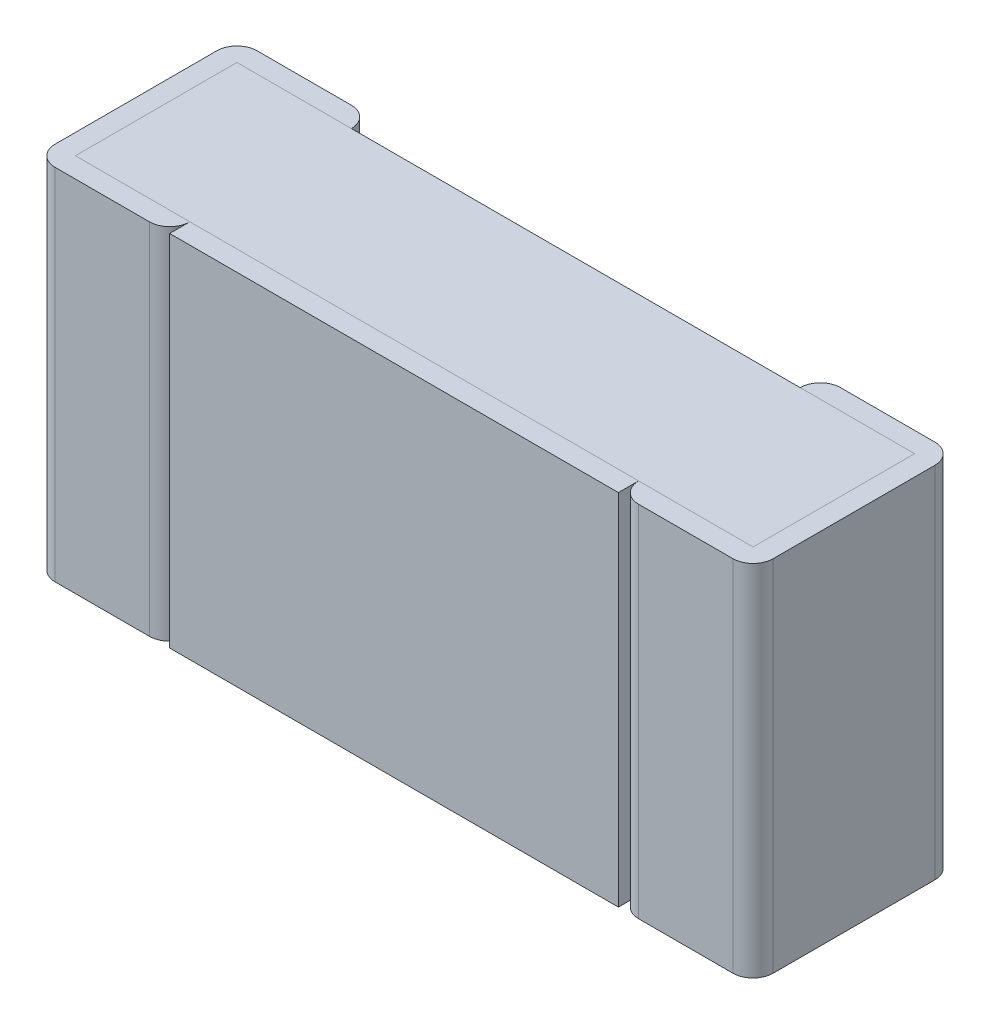
ISO-10303-21;
HEADER;
FILE_DESCRIPTION(('STEP AP214'),'2;1');
FILE_NAME('part.step','',(''),(''),'','','');
FILE_SCHEMA(('AUTOMOTIVE_DESIGN { 1 0 10303 214 1 1 1 1 }'));
ENDSEC;
DATA;
#1=APPLICATION_CONTEXT('core data for automotive mechanical design processes');
#2=APPLICATION_PROTOCOL_DEFINITION('international standard','automotive_design',2000,#1);
#3=PRODUCT_CONTEXT('',#1,'mechanical');
#4=PRODUCT('Part','Part','',(#3));
#5=PRODUCT_RELATED_PRODUCT_CATEGORY('part','',(#4));
#6=PRODUCT_DEFINITION_FORMATION('','',#4);
#7=PRODUCT_DEFINITION_CONTEXT('part definition',#1,'design');
#8=PRODUCT_DEFINITION('design','',#6,#7);
#9=PRODUCT_DEFINITION_SHAPE('','',#8);
#10=(LENGTH_UNIT() NAMED_UNIT(*) SI_UNIT(.MILLI.,.METRE.));
#11=(NAMED_UNIT(*) PLANE_ANGLE_UNIT() SI_UNIT($,.RADIAN.));
#12=(NAMED_UNIT(*) SI_UNIT($,.STERADIAN.) SOLID_ANGLE_UNIT());
#13=UNCERTAINTY_MEASURE_WITH_UNIT(LENGTH_MEASURE(1.E-05),#10,'distance_accuracy_value','');
#14=(GEOMETRIC_REPRESENTATION_CONTEXT(3) GLOBAL_UNCERTAINTY_ASSIGNED_CONTEXT((#13)) GLOBAL_UNIT_ASSIGNED_CONTEXT((#10,
#11,#12)) REPRESENTATION_CONTEXT('',''));
#15=CARTESIAN_POINT('',(0.,0.,0.));
#16=DIRECTION('',(0.,0.,1.));
#17=DIRECTION('',(1.,0.,0.));
#18=AXIS2_PLACEMENT_3D('',#15,#16,#17);
#19=CARTESIAN_POINT('',(-0.5,-0.4,0.45));
#20=DIRECTION('',(0.,0.,1.));
#21=DIRECTION('',(1.,0.,0.));
#22=AXIS2_PLACEMENT_3D('',#19,#20,#21);
#23=PLANE('',#22);
#24=DIRECTION('',(0.,1.,0.));
#25=VECTOR('',#24,1.);
#26=CARTESIAN_POINT('',(-0.5,-0.4,0.45));
#27=LINE('',#26,#25);
#28=CARTESIAN_POINT('',(-0.5,-0.4,0.45));
#29=VERTEX_POINT('',#28);
#30=CARTESIAN_POINT('',(-0.5,0.4,0.45));
#31=VERTEX_POINT('',#30);
#32=EDGE_CURVE('E268',#29,#31,#27,.T.);
#33=ORIENTED_EDGE('',*,*,#32,.F.);
#34=DIRECTION('',(1.,0.,0.));
#35=VECTOR('',#34,1.);
#36=CARTESIAN_POINT('',(-0.5,-0.4,0.45));
#37=LINE('',#36,#35);
#38=CARTESIAN_POINT('',(0.5,-0.4,0.45));
#39=VERTEX_POINT('',#38);
#40=EDGE_CURVE('E223',#29,#39,#37,.T.);
#41=ORIENTED_EDGE('',*,*,#40,.T.);
#42=DIRECTION('',(0.,1.,0.));
#43=VECTOR('',#42,1.);
#44=CARTESIAN_POINT('',(0.5,-0.4,0.45));
#45=LINE('',#44,#43);
#46=CARTESIAN_POINT('',(0.5,0.4,0.45));
#47=VERTEX_POINT('',#46);
#48=EDGE_CURVE('E11',#39,#47,#45,.T.);
#49=ORIENTED_EDGE('',*,*,#48,.T.);
#50=DIRECTION('',(1.,0.,0.));
#51=VECTOR('',#50,1.);
#52=CARTESIAN_POINT('',(-0.5,0.4,0.45));
#53=LINE('',#52,#51);
#54=EDGE_CURVE('E290',#31,#47,#53,.T.);
#55=ORIENTED_EDGE('',*,*,#54,.F.);
#56=EDGE_LOOP('',(#33,#41,#49,#55));
#57=FACE_BOUND('',#56,.T.);
#58=ADVANCED_FACE('F19',(#57),#23,.T.);
#59=CARTESIAN_POINT('',(0.5,-0.4,0.405));
#60=DIRECTION('',(1.,0.,0.));
#61=DIRECTION('',(0.,1.,0.));
#62=AXIS2_PLACEMENT_3D('',#59,#60,#61);
#63=PLANE('',#62);
#64=DIRECTION('',(0.,0.,1.));
#65=VECTOR('',#64,1.);
#66=CARTESIAN_POINT('',(0.5,-0.4,0.405));
#67=LINE('',#66,#65);
#68=CARTESIAN_POINT('',(0.5,-0.4,0.405));
#69=VERTEX_POINT('',#68);
#70=EDGE_CURVE('E219',#69,#39,#67,.T.);
#71=ORIENTED_EDGE('',*,*,#70,.F.);
#72=DIRECTION('',(0.,1.,0.));
#73=VECTOR('',#72,1.);
#74=CARTESIAN_POINT('',(0.5,-0.4,0.405));
#75=LINE('',#74,#73);
#76=CARTESIAN_POINT('',(0.5,0.4,0.405));
#77=VERTEX_POINT('',#76);
#78=EDGE_CURVE('E30',#69,#77,#75,.T.);
#79=ORIENTED_EDGE('',*,*,#78,.T.);
#80=DIRECTION('',(0.,0.,1.));
#81=VECTOR('',#80,1.);
#82=CARTESIAN_POINT('',(0.5,0.4,0.405));
#83=LINE('',#82,#81);
#84=EDGE_CURVE('E287',#77,#47,#83,.T.);
#85=ORIENTED_EDGE('',*,*,#84,.T.);
#86=ORIENTED_EDGE('',*,*,#48,.F.);
#87=EDGE_LOOP('',(#71,#79,#85,#86));
#88=FACE_BOUND('',#87,.T.);
#89=ADVANCED_FACE('F437',(#88),#63,.T.);
#90=CARTESIAN_POINT('',(0.545,-0.4,0.405));
#91=DIRECTION('',(0.,1.,0.));
#92=DIRECTION('',(-1.,0.,0.));
#93=AXIS2_PLACEMENT_3D('',#90,#91,#92);
#94=CYLINDRICAL_SURFACE('',#93,0.045);
#95=CARTESIAN_POINT('',(0.545,-0.4,0.405));
#96=DIRECTION('',(0.,1.,0.));
#97=DIRECTION('',(0.,0.,1.));
#98=AXIS2_PLACEMENT_3D('',#95,#96,#97);
#99=CIRCLE('',#98,0.045);
#100=CARTESIAN_POINT('',(0.545,-0.4,0.45));
#101=VERTEX_POINT('',#100);
#102=EDGE_CURVE('E349',#69,#101,#99,.T.);
#103=ORIENTED_EDGE('',*,*,#102,.T.);
#104=DIRECTION('',(0.,1.,0.));
#105=VECTOR('',#104,1.);
#106=CARTESIAN_POINT('',(0.545,-0.4,0.45));
#107=LINE('',#106,#105);
#108=CARTESIAN_POINT('',(0.545,0.4,0.45));
#109=VERTEX_POINT('',#108);
#110=EDGE_CURVE('E245',#101,#109,#107,.T.);
#111=ORIENTED_EDGE('',*,*,#110,.T.);
#112=CARTESIAN_POINT('',(0.545,0.4,0.405));
#113=DIRECTION('',(0.,1.,0.));
#114=DIRECTION('',(0.,0.,1.));
#115=AXIS2_PLACEMENT_3D('',#112,#113,#114);
#116=CIRCLE('',#115,0.045);
#117=EDGE_CURVE('E300',#77,#109,#116,.T.);
#118=ORIENTED_EDGE('',*,*,#117,.F.);
#119=ORIENTED_EDGE('',*,*,#78,.F.);
#120=EDGE_LOOP('',(#103,#111,#118,#119));
#121=FACE_BOUND('',#120,.T.);
#122=ADVANCED_FACE('F446',(#121),#94,.T.);
#123=CARTESIAN_POINT('',(0.5,-0.4,0.45));
#124=DIRECTION('',(0.,0.,1.));
#125=DIRECTION('',(1.,0.,0.));
#126=AXIS2_PLACEMENT_3D('',#123,#124,#125);
#127=PLANE('',#126);
#128=DIRECTION('',(1.,0.,0.));
#129=VECTOR('',#128,1.);
#130=CARTESIAN_POINT('',(0.5,0.4,0.45));
#131=LINE('',#130,#129);
#132=CARTESIAN_POINT('',(0.755,0.4,0.45));
#133=VERTEX_POINT('',#132);
#134=EDGE_CURVE('E259',#109,#133,#131,.T.);
#135=ORIENTED_EDGE('',*,*,#134,.F.);
#136=ORIENTED_EDGE('',*,*,#110,.F.);
#137=DIRECTION('',(1.,0.,0.));
#138=VECTOR('',#137,1.);
#139=CARTESIAN_POINT('',(0.5,-0.4,0.45));
#140=LINE('',#139,#138);
#141=CARTESIAN_POINT('',(0.755,-0.4,0.45));
#142=VERTEX_POINT('',#141);
#143=EDGE_CURVE('E345',#101,#142,#140,.T.);
#144=ORIENTED_EDGE('',*,*,#143,.T.);
#145=DIRECTION('',(0.,1.,0.));
#146=VECTOR('',#145,1.);
#147=CARTESIAN_POINT('',(0.755,-0.4,0.45));
#148=LINE('',#147,#146);
#149=EDGE_CURVE('E249',#142,#133,#148,.T.);
#150=ORIENTED_EDGE('',*,*,#149,.T.);
#151=EDGE_LOOP('',(#135,#136,#144,#150));
#152=FACE_BOUND('',#151,.T.);
#153=ADVANCED_FACE('F562',(#152),#127,.T.);
#154=CARTESIAN_POINT('',(0.755,-0.4,0.405));
#155=DIRECTION('',(0.,1.,0.));
#156=DIRECTION('',(1.,0.,0.));
#157=AXIS2_PLACEMENT_3D('',#154,#155,#156);
#158=CYLINDRICAL_SURFACE('',#157,0.045);
#159=DIRECTION('',(0.,1.,0.));
#160=VECTOR('',#159,1.);
#161=CARTESIAN_POINT('',(0.8,-0.4,0.405));
#162=LINE('',#161,#160);
#163=CARTESIAN_POINT('',(0.8,-0.4,0.405));
#164=VERTEX_POINT('',#163);
#165=CARTESIAN_POINT('',(0.8,0.4,0.405));
#166=VERTEX_POINT('',#165);
#167=EDGE_CURVE('E253',#164,#166,#162,.T.);
#168=ORIENTED_EDGE('',*,*,#167,.T.);
#169=CARTESIAN_POINT('',(0.755,0.4,0.405));
#170=DIRECTION('',(0.,-1.,0.));
#171=DIRECTION('',(0.,0.,1.));
#172=AXIS2_PLACEMENT_3D('',#169,#170,#171);
#173=CIRCLE('',#172,0.045);
#174=EDGE_CURVE('E254',#166,#133,#173,.T.);
#175=ORIENTED_EDGE('',*,*,#174,.T.);
#176=ORIENTED_EDGE('',*,*,#149,.F.);
#177=CARTESIAN_POINT('',(0.755,-0.4,0.405));
#178=DIRECTION('',(0.,-1.,0.));
#179=DIRECTION('',(0.,0.,1.));
#180=AXIS2_PLACEMENT_3D('',#177,#178,#179);
#181=CIRCLE('',#180,0.045);
#182=EDGE_CURVE('E324',#164,#142,#181,.T.);
#183=ORIENTED_EDGE('',*,*,#182,.F.);
#184=EDGE_LOOP('',(#168,#175,#176,#183));
#185=FACE_BOUND('',#184,.T.);
#186=ADVANCED_FACE('F553',(#185),#158,.T.);
#187=CARTESIAN_POINT('',(0.8,-0.4,0.));
#188=DIRECTION('',(1.,0.,0.));
#189=DIRECTION('',(0.,1.,0.));
#190=AXIS2_PLACEMENT_3D('',#187,#188,#189);
#191=PLANE('',#190);
#192=DIRECTION('',(0.,0.,1.));
#193=VECTOR('',#192,1.);
#194=CARTESIAN_POINT('',(0.8,-0.4,0.));
#195=LINE('',#194,#193);
#196=CARTESIAN_POINT('',(0.8,-0.4,0.045));
#197=VERTEX_POINT('',#196);
#198=EDGE_CURVE('E315',#197,#164,#195,.T.);
#199=ORIENTED_EDGE('',*,*,#198,.F.);
#200=DIRECTION('',(0.,1.,0.));
#201=VECTOR('',#200,1.);
#202=CARTESIAN_POINT('',(0.8,-0.4,0.045));
#203=LINE('',#202,#201);
#204=CARTESIAN_POINT('',(0.8,0.4,0.045));
#205=VERTEX_POINT('',#204);
#206=EDGE_CURVE('E243',#197,#205,#203,.T.);
#207=ORIENTED_EDGE('',*,*,#206,.T.);
#208=DIRECTION('',(0.,0.,1.));
#209=VECTOR('',#208,1.);
#210=CARTESIAN_POINT('',(0.8,0.4,0.));
#211=LINE('',#210,#209);
#212=EDGE_CURVE('E258',#205,#166,#211,.T.);
#213=ORIENTED_EDGE('',*,*,#212,.T.);
#214=ORIENTED_EDGE('',*,*,#167,.F.);
#215=EDGE_LOOP('',(#199,#207,#213,#214));
#216=FACE_BOUND('',#215,.T.);
#217=ADVANCED_FACE('F549',(#216),#191,.T.);
#218=CARTESIAN_POINT('',(0.755,-0.4,0.045));
#219=DIRECTION('',(0.,1.,0.));
#220=DIRECTION('',(1.,0.,0.));
#221=AXIS2_PLACEMENT_3D('',#218,#219,#220);
#222=CYLINDRICAL_SURFACE('',#221,0.045);
#223=CARTESIAN_POINT('',(0.755,-0.4,0.045));
#224=DIRECTION('',(0.,1.,0.));
#225=DIRECTION('',(0.,0.,1.));
#226=AXIS2_PLACEMENT_3D('',#223,#224,#225);
#227=CIRCLE('',#226,0.045);
#228=CARTESIAN_POINT('',(0.755,-0.4,0.));
#229=VERTEX_POINT('',#228);
#230=EDGE_CURVE('E311',#197,#229,#227,.T.);
#231=ORIENTED_EDGE('',*,*,#230,.T.);
#232=DIRECTION('',(0.,1.,0.));
#233=VECTOR('',#232,1.);
#234=CARTESIAN_POINT('',(0.755,-0.4,0.));
#235=LINE('',#234,#233);
#236=CARTESIAN_POINT('',(0.755,0.4,0.));
#237=VERTEX_POINT('',#236);
#238=EDGE_CURVE('E240',#229,#237,#235,.T.);
#239=ORIENTED_EDGE('',*,*,#238,.T.);
#240=CARTESIAN_POINT('',(0.755,0.4,0.045));
#241=DIRECTION('',(0.,1.,0.));
#242=DIRECTION('',(0.,0.,1.));
#243=AXIS2_PLACEMENT_3D('',#240,#241,#242);
#244=CIRCLE('',#243,0.045);
#245=EDGE_CURVE('E386',#205,#237,#244,.T.);
#246=ORIENTED_EDGE('',*,*,#245,.F.);
#247=ORIENTED_EDGE('',*,*,#206,.F.);
#248=EDGE_LOOP('',(#231,#239,#246,#247));
#249=FACE_BOUND('',#248,.T.);
#250=ADVANCED_FACE('F555',(#249),#222,.T.);
#251=CARTESIAN_POINT('',(0.5,-0.4,0.));
#252=DIRECTION('',(0.,0.,1.));
#253=DIRECTION('',(1.,0.,0.));
#254=AXIS2_PLACEMENT_3D('',#251,#252,#253);
#255=PLANE('',#254);
#256=ORIENTED_EDGE('',*,*,#238,.F.);
#257=DIRECTION('',(1.,0.,0.));
#258=VECTOR('',#257,1.);
#259=CARTESIAN_POINT('',(0.5,-0.4,0.));
#260=LINE('',#259,#258);
#261=CARTESIAN_POINT('',(0.545,-0.4,0.));
#262=VERTEX_POINT('',#261);
#263=EDGE_CURVE('E224',#262,#229,#260,.T.);
#264=ORIENTED_EDGE('',*,*,#263,.F.);
#265=DIRECTION('',(0.,1.,0.));
#266=VECTOR('',#265,1.);
#267=CARTESIAN_POINT('',(0.545,-0.4,0.));
#268=LINE('',#267,#266);
#269=CARTESIAN_POINT('',(0.545,0.4,0.));
#270=VERTEX_POINT('',#269);
#271=EDGE_CURVE('E244',#262,#270,#268,.T.);
#272=ORIENTED_EDGE('',*,*,#271,.T.);
#273=DIRECTION('',(1.,0.,0.));
#274=VECTOR('',#273,1.);
#275=CARTESIAN_POINT('',(0.5,0.4,0.));
#276=LINE('',#275,#274);
#277=EDGE_CURVE('E267',#270,#237,#276,.T.);
#278=ORIENTED_EDGE('',*,*,#277,.T.);
#279=EDGE_LOOP('',(#256,#264,#272,#278));
#280=FACE_BOUND('',#279,.T.);
#281=ADVANCED_FACE('F582',(#280),#255,.F.);
#282=CARTESIAN_POINT('',(0.545,-0.4,0.045));
#283=DIRECTION('',(0.,1.,0.));
#284=DIRECTION('',(-1.,0.,0.));
#285=AXIS2_PLACEMENT_3D('',#282,#283,#284);
#286=CYLINDRICAL_SURFACE('',#285,0.045);
#287=DIRECTION('',(0.,1.,0.));
#288=VECTOR('',#287,1.);
#289=CARTESIAN_POINT('',(0.5,-0.4,0.045));
#290=LINE('',#289,#288);
#291=CARTESIAN_POINT('',(0.5,-0.4,0.045));
#292=VERTEX_POINT('',#291);
#293=CARTESIAN_POINT('',(0.5,0.4,0.045));
#294=VERTEX_POINT('',#293);
#295=EDGE_CURVE('E234',#292,#294,#290,.T.);
#296=ORIENTED_EDGE('',*,*,#295,.T.);
#297=CARTESIAN_POINT('',(0.545,0.4,0.045));
#298=DIRECTION('',(0.,-1.,0.));
#299=DIRECTION('',(0.,0.,1.));
#300=AXIS2_PLACEMENT_3D('',#297,#298,#299);
#301=CIRCLE('',#300,0.045);
#302=EDGE_CURVE('E23',#294,#270,#301,.T.);
#303=ORIENTED_EDGE('',*,*,#302,.T.);
#304=ORIENTED_EDGE('',*,*,#271,.F.);
#305=CARTESIAN_POINT('',(0.545,-0.4,0.045));
#306=DIRECTION('',(0.,-1.,0.));
#307=DIRECTION('',(0.,0.,1.));
#308=AXIS2_PLACEMENT_3D('',#305,#306,#307);
#309=CIRCLE('',#308,0.045);
#310=EDGE_CURVE('E377',#292,#262,#309,.T.);
#311=ORIENTED_EDGE('',*,*,#310,.F.);
#312=EDGE_LOOP('',(#296,#303,#304,#311));
#313=FACE_BOUND('',#312,.T.);
#314=ADVANCED_FACE('F524',(#313),#286,.T.);
#315=CARTESIAN_POINT('',(-0.5,0.4,0.405));
#316=DIRECTION('',(0.,1.,0.));
#317=DIRECTION('',(1.,0.,0.));
#318=AXIS2_PLACEMENT_3D('',#315,#316,#317);
#319=PLANE('',#318);
#320=DIRECTION('',(1.,0.,0.));
#321=VECTOR('',#320,1.);
#322=CARTESIAN_POINT('',(-0.5,0.4,0.405));
#323=LINE('',#322,#321);
#324=CARTESIAN_POINT('',(-0.5,0.4,0.405));
#325=VERTEX_POINT('',#324);
#326=EDGE_CURVE('E277',#325,#77,#323,.T.);
#327=ORIENTED_EDGE('',*,*,#326,.F.);
#328=DIRECTION('',(0.,0.,1.));
#329=VECTOR('',#328,1.);
#330=CARTESIAN_POINT('',(-0.5,0.4,0.405));
#331=LINE('',#330,#329);
#332=EDGE_CURVE('E263',#325,#31,#331,.T.);
#333=ORIENTED_EDGE('',*,*,#332,.T.);
#334=ORIENTED_EDGE('',*,*,#54,.T.);
#335=ORIENTED_EDGE('',*,*,#84,.F.);
#336=EDGE_LOOP('',(#327,#333,#334,#335));
#337=FACE_BOUND('',#336,.T.);
#338=ADVANCED_FACE('F482',(#337),#319,.T.);
#339=CARTESIAN_POINT('',(0.5,0.4,0.));
#340=DIRECTION('',(0.,1.,0.));
#341=DIRECTION('',(1.,0.,0.));
#342=AXIS2_PLACEMENT_3D('',#339,#340,#341);
#343=PLANE('',#342);
#344=ORIENTED_EDGE('',*,*,#277,.F.);
#345=ORIENTED_EDGE('',*,*,#302,.F.);
#346=DIRECTION('',(1.,0.,0.));
#347=VECTOR('',#346,1.);
#348=CARTESIAN_POINT('',(-0.755,0.4,0.045));
#349=LINE('',#348,#347);
#350=CARTESIAN_POINT('',(0.755,0.4,0.045));
#351=VERTEX_POINT('',#350);
#352=EDGE_CURVE('E235',#294,#351,#349,.T.);
#353=ORIENTED_EDGE('',*,*,#352,.T.);
#354=DIRECTION('',(0.,0.,1.));
#355=VECTOR('',#354,1.);
#356=CARTESIAN_POINT('',(0.755,0.4,0.045));
#357=LINE('',#356,#355);
#358=CARTESIAN_POINT('',(0.755,0.4,0.405));
#359=VERTEX_POINT('',#358);
#360=EDGE_CURVE('E239',#351,#359,#357,.T.);
#361=ORIENTED_EDGE('',*,*,#360,.T.);
#362=DIRECTION('',(1.,0.,0.));
#363=VECTOR('',#362,1.);
#364=CARTESIAN_POINT('',(-0.755,0.4,0.405));
#365=LINE('',#364,#363);
#366=EDGE_CURVE('E293',#77,#359,#365,.T.);
#367=ORIENTED_EDGE('',*,*,#366,.F.);
#368=ORIENTED_EDGE('',*,*,#117,.T.);
#369=ORIENTED_EDGE('',*,*,#134,.T.);
#370=ORIENTED_EDGE('',*,*,#174,.F.);
#371=ORIENTED_EDGE('',*,*,#212,.F.);
#372=ORIENTED_EDGE('',*,*,#245,.T.);
#373=EDGE_LOOP('',(#344,#345,#353,#361,#367,#368,#369,#370,#371,#372));
#374=FACE_BOUND('',#373,.T.);
#375=ADVANCED_FACE('F559',(#374),#343,.T.);
#376=CARTESIAN_POINT('',(-0.5,-0.4,0.405));
#377=DIRECTION('',(1.,0.,0.));
#378=DIRECTION('',(0.,1.,0.));
#379=AXIS2_PLACEMENT_3D('',#376,#377,#378);
#380=PLANE('',#379);
#381=ORIENTED_EDGE('',*,*,#32,.T.);
#382=ORIENTED_EDGE('',*,*,#332,.F.);
#383=DIRECTION('',(0.,1.,0.));
#384=VECTOR('',#383,1.);
#385=CARTESIAN_POINT('',(-0.5,-0.4,0.405));
#386=LINE('',#385,#384);
#387=CARTESIAN_POINT('',(-0.5,-0.4,0.405));
#388=VERTEX_POINT('',#387);
#389=EDGE_CURVE('E273',#388,#325,#386,.T.);
#390=ORIENTED_EDGE('',*,*,#389,.F.);
#391=DIRECTION('',(0.,0.,1.));
#392=VECTOR('',#391,1.);
#393=CARTESIAN_POINT('',(-0.5,-0.4,0.405));
#394=LINE('',#393,#392);
#395=EDGE_CURVE('E98',#388,#29,#394,.T.);
#396=ORIENTED_EDGE('',*,*,#395,.T.);
#397=EDGE_LOOP('',(#381,#382,#390,#396));
#398=FACE_BOUND('',#397,.T.);
#399=ADVANCED_FACE('F427',(#398),#380,.F.);
#400=CARTESIAN_POINT('',(-0.5,-0.4,0.405));
#401=DIRECTION('',(0.,1.,0.));
#402=DIRECTION('',(1.,0.,0.));
#403=AXIS2_PLACEMENT_3D('',#400,#401,#402);
#404=PLANE('',#403);
#405=ORIENTED_EDGE('',*,*,#70,.T.);
#406=ORIENTED_EDGE('',*,*,#40,.F.);
#407=ORIENTED_EDGE('',*,*,#395,.F.);
#408=DIRECTION('',(1.,0.,0.));
#409=VECTOR('',#408,1.);
#410=CARTESIAN_POINT('',(-0.5,-0.4,0.405));
#411=LINE('',#410,#409);
#412=EDGE_CURVE('E228',#388,#69,#411,.T.);
#413=ORIENTED_EDGE('',*,*,#412,.T.);
#414=EDGE_LOOP('',(#405,#406,#407,#413));
#415=FACE_BOUND('',#414,.T.);
#416=ADVANCED_FACE('F431',(#415),#404,.F.);
#417=CARTESIAN_POINT('',(0.5,-0.4,0.));
#418=DIRECTION('',(0.,1.,0.));
#419=DIRECTION('',(1.,0.,0.));
#420=AXIS2_PLACEMENT_3D('',#417,#418,#419);
#421=PLANE('',#420);
#422=ORIENTED_EDGE('',*,*,#230,.F.);
#423=ORIENTED_EDGE('',*,*,#198,.T.);
#424=ORIENTED_EDGE('',*,*,#182,.T.);
#425=ORIENTED_EDGE('',*,*,#143,.F.);
#426=ORIENTED_EDGE('',*,*,#102,.F.);
#427=DIRECTION('',(1.,0.,0.));
#428=VECTOR('',#427,1.);
#429=CARTESIAN_POINT('',(-0.755,-0.4,0.405));
#430=LINE('',#429,#428);
#431=CARTESIAN_POINT('',(0.755,-0.4,0.405));
#432=VERTEX_POINT('',#431);
#433=EDGE_CURVE('E225',#69,#432,#430,.T.);
#434=ORIENTED_EDGE('',*,*,#433,.T.);
#435=DIRECTION('',(0.,0.,1.));
#436=VECTOR('',#435,1.);
#437=CARTESIAN_POINT('',(0.755,-0.4,0.045));
#438=LINE('',#437,#436);
#439=CARTESIAN_POINT('',(0.755,-0.4,0.045));
#440=VERTEX_POINT('',#439);
#441=EDGE_CURVE('E229',#440,#432,#438,.T.);
#442=ORIENTED_EDGE('',*,*,#441,.F.);
#443=DIRECTION('',(1.,0.,0.));
#444=VECTOR('',#443,1.);
#445=CARTESIAN_POINT('',(-0.755,-0.4,0.045));
#446=LINE('',#445,#444);
#447=EDGE_CURVE('E271',#292,#440,#446,.T.);
#448=ORIENTED_EDGE('',*,*,#447,.F.);
#449=ORIENTED_EDGE('',*,*,#310,.T.);
#450=ORIENTED_EDGE('',*,*,#263,.T.);
#451=EDGE_LOOP('',(#422,#423,#424,#425,#426,#434,#442,#448,#449,#450));
#452=FACE_BOUND('',#451,.T.);
#453=ADVANCED_FACE('F442',(#452),#421,.F.);
#454=CARTESIAN_POINT('',(-0.755,-0.4,0.045));
#455=DIRECTION('',(0.,0.,1.));
#456=DIRECTION('',(1.,0.,0.));
#457=AXIS2_PLACEMENT_3D('',#454,#455,#456);
#458=PLANE('',#457);
#459=DIRECTION('',(1.,0.,0.));
#460=VECTOR('',#459,1.);
#461=CARTESIAN_POINT('',(-0.755,0.4,0.045));
#462=LINE('',#461,#460);
#463=CARTESIAN_POINT('',(-0.5,0.4,0.045));
#464=VERTEX_POINT('',#463);
#465=EDGE_CURVE('E230',#464,#294,#462,.T.);
#466=ORIENTED_EDGE('',*,*,#465,.T.);
#467=ORIENTED_EDGE('',*,*,#295,.F.);
#468=DIRECTION('',(1.,0.,0.));
#469=VECTOR('',#468,1.);
#470=CARTESIAN_POINT('',(-0.755,-0.4,0.045));
#471=LINE('',#470,#469);
#472=CARTESIAN_POINT('',(-0.5,-0.4,0.045));
#473=VERTEX_POINT('',#472);
#474=EDGE_CURVE('E308',#473,#292,#471,.T.);
#475=ORIENTED_EDGE('',*,*,#474,.F.);
#476=DIRECTION('',(0.,1.,0.));
#477=VECTOR('',#476,1.);
#478=CARTESIAN_POINT('',(-0.5,-0.4,0.045));
#479=LINE('',#478,#477);
#480=EDGE_CURVE('E181',#473,#464,#479,.T.);
#481=ORIENTED_EDGE('',*,*,#480,.T.);
#482=EDGE_LOOP('',(#466,#467,#475,#481));
#483=FACE_BOUND('',#482,.T.);
#484=ADVANCED_FACE('F528',(#483),#458,.F.);
#485=CARTESIAN_POINT('',(-0.755,0.4,0.045));
#486=DIRECTION('',(0.,1.,0.));
#487=DIRECTION('',(1.,0.,0.));
#488=AXIS2_PLACEMENT_3D('',#485,#486,#487);
#489=PLANE('',#488);
#490=DIRECTION('',(1.,0.,0.));
#491=VECTOR('',#490,1.);
#492=CARTESIAN_POINT('',(-0.755,0.4,0.045));
#493=LINE('',#492,#491);
#494=CARTESIAN_POINT('',(-0.755,0.4,0.045));
#495=VERTEX_POINT('',#494);
#496=EDGE_CURVE('E189',#495,#464,#493,.T.);
#497=ORIENTED_EDGE('',*,*,#496,.F.);
#498=DIRECTION('',(0.,0.,1.));
#499=VECTOR('',#498,1.);
#500=CARTESIAN_POINT('',(-0.755,0.4,0.045));
#501=LINE('',#500,#499);
#502=CARTESIAN_POINT('',(-0.755,0.4,0.405));
#503=VERTEX_POINT('',#502);
#504=EDGE_CURVE('E262',#495,#503,#501,.T.);
#505=ORIENTED_EDGE('',*,*,#504,.T.);
#506=DIRECTION('',(1.,0.,0.));
#507=VECTOR('',#506,1.);
#508=CARTESIAN_POINT('',(-0.755,0.4,0.405));
#509=LINE('',#508,#507);
#510=EDGE_CURVE('E392',#503,#325,#509,.T.);
#511=ORIENTED_EDGE('',*,*,#510,.T.);
#512=ORIENTED_EDGE('',*,*,#326,.T.);
#513=ORIENTED_EDGE('',*,*,#366,.T.);
#514=ORIENTED_EDGE('',*,*,#360,.F.);
#515=ORIENTED_EDGE('',*,*,#352,.F.);
#516=ORIENTED_EDGE('',*,*,#465,.F.);
#517=EDGE_LOOP('',(#497,#505,#511,#512,#513,#514,#515,#516));
#518=FACE_BOUND('',#517,.T.);
#519=ADVANCED_FACE('F415',(#518),#489,.T.);
#520=CARTESIAN_POINT('',(-0.545,-0.4,0.405));
#521=DIRECTION('',(0.,1.,0.));
#522=DIRECTION('',(1.,0.,0.));
#523=AXIS2_PLACEMENT_3D('',#520,#521,#522);
#524=CYLINDRICAL_SURFACE('',#523,0.045);
#525=ORIENTED_EDGE('',*,*,#389,.T.);
#526=CARTESIAN_POINT('',(-0.545,0.4,0.405));
#527=DIRECTION('',(0.,-1.,0.));
#528=DIRECTION('',(0.,0.,1.));
#529=AXIS2_PLACEMENT_3D('',#526,#527,#528);
#530=CIRCLE('',#529,0.045);
#531=CARTESIAN_POINT('',(-0.545,0.4,0.45));
#532=VERTEX_POINT('',#531);
#533=EDGE_CURVE('E205',#325,#532,#530,.T.);
#534=ORIENTED_EDGE('',*,*,#533,.T.);
#535=DIRECTION('',(0.,1.,0.));
#536=VECTOR('',#535,1.);
#537=CARTESIAN_POINT('',(-0.545,-0.4,0.45));
#538=LINE('',#537,#536);
#539=CARTESIAN_POINT('',(-0.545,-0.4,0.45));
#540=VERTEX_POINT('',#539);
#541=EDGE_CURVE('E83',#540,#532,#538,.T.);
#542=ORIENTED_EDGE('',*,*,#541,.F.);
#543=CARTESIAN_POINT('',(-0.545,-0.4,0.405));
#544=DIRECTION('',(0.,-1.,0.));
#545=DIRECTION('',(0.,0.,1.));
#546=AXIS2_PLACEMENT_3D('',#543,#544,#545);
#547=CIRCLE('',#546,0.045);
#548=EDGE_CURVE('E281',#388,#540,#547,.T.);
#549=ORIENTED_EDGE('',*,*,#548,.F.);
#550=EDGE_LOOP('',(#525,#534,#542,#549));
#551=FACE_BOUND('',#550,.T.);
#552=ADVANCED_FACE('F423',(#551),#524,.T.);
#553=CARTESIAN_POINT('',(-0.8,-0.4,0.45));
#554=DIRECTION('',(0.,0.,1.));
#555=DIRECTION('',(1.,0.,0.));
#556=AXIS2_PLACEMENT_3D('',#553,#554,#555);
#557=PLANE('',#556);
#558=DIRECTION('',(1.,0.,0.));
#559=VECTOR('',#558,1.);
#560=CARTESIAN_POINT('',(-0.8,0.4,0.45));
#561=LINE('',#560,#559);
#562=CARTESIAN_POINT('',(-0.755,0.4,0.45));
#563=VERTEX_POINT('',#562);
#564=EDGE_CURVE('E197',#563,#532,#561,.T.);
#565=ORIENTED_EDGE('',*,*,#564,.F.);
#566=DIRECTION('',(0.,1.,0.));
#567=VECTOR('',#566,1.);
#568=CARTESIAN_POINT('',(-0.755,-0.4,0.45));
#569=LINE('',#568,#567);
#570=CARTESIAN_POINT('',(-0.755,-0.4,0.45));
#571=VERTEX_POINT('',#570);
#572=EDGE_CURVE('E209',#571,#563,#569,.T.);
#573=ORIENTED_EDGE('',*,*,#572,.F.);
#574=DIRECTION('',(1.,0.,0.));
#575=VECTOR('',#574,1.);
#576=CARTESIAN_POINT('',(-0.8,-0.4,0.45));
#577=LINE('',#576,#575);
#578=EDGE_CURVE('E285',#571,#540,#577,.T.);
#579=ORIENTED_EDGE('',*,*,#578,.T.);
#580=ORIENTED_EDGE('',*,*,#541,.T.);
#581=EDGE_LOOP('',(#565,#573,#579,#580));
#582=FACE_BOUND('',#581,.T.);
#583=ADVANCED_FACE('F642',(#582),#557,.T.);
#584=CARTESIAN_POINT('',(-0.755,-0.4,0.045));
#585=DIRECTION('',(0.,1.,0.));
#586=DIRECTION('',(1.,0.,0.));
#587=AXIS2_PLACEMENT_3D('',#584,#585,#586);
#588=PLANE('',#587);
#589=ORIENTED_EDGE('',*,*,#474,.T.);
#590=ORIENTED_EDGE('',*,*,#447,.T.);
#591=ORIENTED_EDGE('',*,*,#441,.T.);
#592=ORIENTED_EDGE('',*,*,#433,.F.);
#593=ORIENTED_EDGE('',*,*,#412,.F.);
#594=DIRECTION('',(1.,0.,0.));
#595=VECTOR('',#594,1.);
#596=CARTESIAN_POINT('',(-0.755,-0.4,0.405));
#597=LINE('',#596,#595);
#598=CARTESIAN_POINT('',(-0.755,-0.4,0.405));
#599=VERTEX_POINT('',#598);
#600=EDGE_CURVE('E286',#599,#388,#597,.T.);
#601=ORIENTED_EDGE('',*,*,#600,.F.);
#602=DIRECTION('',(0.,0.,1.));
#603=VECTOR('',#602,1.);
#604=CARTESIAN_POINT('',(-0.755,-0.4,0.045));
#605=LINE('',#604,#603);
#606=CARTESIAN_POINT('',(-0.755,-0.4,0.045));
#607=VERTEX_POINT('',#606);
#608=EDGE_CURVE('E304',#607,#599,#605,.T.);
#609=ORIENTED_EDGE('',*,*,#608,.F.);
#610=DIRECTION('',(1.,0.,0.));
#611=VECTOR('',#610,1.);
#612=CARTESIAN_POINT('',(-0.755,-0.4,0.045));
#613=LINE('',#612,#611);
#614=EDGE_CURVE('E213',#607,#473,#613,.T.);
#615=ORIENTED_EDGE('',*,*,#614,.T.);
#616=EDGE_LOOP('',(#589,#590,#591,#592,#593,#601,#609,#615));
#617=FACE_BOUND('',#616,.T.);
#618=ADVANCED_FACE('F21',(#617),#588,.F.);
#619=CARTESIAN_POINT('',(-0.545,-0.4,0.045));
#620=DIRECTION('',(0.,1.,0.));
#621=DIRECTION('',(1.,0.,0.));
#622=AXIS2_PLACEMENT_3D('',#619,#620,#621);
#623=CYLINDRICAL_SURFACE('',#622,0.045);
#624=CARTESIAN_POINT('',(-0.545,-0.4,0.045));
#625=DIRECTION('',(0.,1.,0.));
#626=DIRECTION('',(0.,0.,1.));
#627=AXIS2_PLACEMENT_3D('',#624,#625,#626);
#628=CIRCLE('',#627,0.045);
#629=CARTESIAN_POINT('',(-0.545,-0.4,0.));
#630=VERTEX_POINT('',#629);
#631=EDGE_CURVE('E175',#473,#630,#628,.T.);
#632=ORIENTED_EDGE('',*,*,#631,.T.);
#633=DIRECTION('',(0.,1.,0.));
#634=VECTOR('',#633,1.);
#635=CARTESIAN_POINT('',(-0.545,-0.4,0.));
#636=LINE('',#635,#634);
#637=CARTESIAN_POINT('',(-0.545,0.4,0.));
#638=VERTEX_POINT('',#637);
#639=EDGE_CURVE('E168',#630,#638,#636,.T.);
#640=ORIENTED_EDGE('',*,*,#639,.T.);
#641=CARTESIAN_POINT('',(-0.545,0.4,0.045));
#642=DIRECTION('',(0.,1.,0.));
#643=DIRECTION('',(0.,0.,1.));
#644=AXIS2_PLACEMENT_3D('',#641,#642,#643);
#645=CIRCLE('',#644,0.045);
#646=EDGE_CURVE('E172',#464,#638,#645,.T.);
#647=ORIENTED_EDGE('',*,*,#646,.F.);
#648=ORIENTED_EDGE('',*,*,#480,.F.);
#649=EDGE_LOOP('',(#632,#640,#647,#648));
#650=FACE_BOUND('',#649,.T.);
#651=ADVANCED_FACE('F170',(#650),#623,.T.);
#652=CARTESIAN_POINT('',(-0.8,-0.4,0.));
#653=DIRECTION('',(0.,0.,1.));
#654=DIRECTION('',(1.,0.,0.));
#655=AXIS2_PLACEMENT_3D('',#652,#653,#654);
#656=PLANE('',#655);
#657=ORIENTED_EDGE('',*,*,#639,.F.);
#658=DIRECTION('',(1.,0.,0.));
#659=VECTOR('',#658,1.);
#660=CARTESIAN_POINT('',(-0.8,-0.4,0.));
#661=LINE('',#660,#659);
#662=CARTESIAN_POINT('',(-0.755,-0.4,0.));
#663=VERTEX_POINT('',#662);
#664=EDGE_CURVE('E331',#663,#630,#661,.T.);
#665=ORIENTED_EDGE('',*,*,#664,.F.);
#666=DIRECTION('',(0.,1.,0.));
#667=VECTOR('',#666,1.);
#668=CARTESIAN_POINT('',(-0.755,-0.4,0.));
#669=LINE('',#668,#667);
#670=CARTESIAN_POINT('',(-0.755,0.4,0.));
#671=VERTEX_POINT('',#670);
#672=EDGE_CURVE('E194',#663,#671,#669,.T.);
#673=ORIENTED_EDGE('',*,*,#672,.T.);
#674=DIRECTION('',(1.,0.,0.));
#675=VECTOR('',#674,1.);
#676=CARTESIAN_POINT('',(-0.8,0.4,0.));
#677=LINE('',#676,#675);
#678=EDGE_CURVE('E186',#671,#638,#677,.T.);
#679=ORIENTED_EDGE('',*,*,#678,.T.);
#680=EDGE_LOOP('',(#657,#665,#673,#679));
#681=FACE_BOUND('',#680,.T.);
#682=ADVANCED_FACE('F192',(#681),#656,.F.);
#683=CARTESIAN_POINT('',(-0.8,0.4,0.));
#684=DIRECTION('',(0.,1.,0.));
#685=DIRECTION('',(1.,0.,0.));
#686=AXIS2_PLACEMENT_3D('',#683,#684,#685);
#687=PLANE('',#686);
#688=ORIENTED_EDGE('',*,*,#678,.F.);
#689=CARTESIAN_POINT('',(-0.755,0.4,0.045));
#690=DIRECTION('',(0.,-1.,0.));
#691=DIRECTION('',(0.,0.,1.));
#692=AXIS2_PLACEMENT_3D('',#689,#690,#691);
#693=CIRCLE('',#692,0.045);
#694=CARTESIAN_POINT('',(-0.8,0.4,0.045));
#695=VERTEX_POINT('',#694);
#696=EDGE_CURVE('E334',#695,#671,#693,.T.);
#697=ORIENTED_EDGE('',*,*,#696,.F.);
#698=DIRECTION('',(0.,0.,1.));
#699=VECTOR('',#698,1.);
#700=CARTESIAN_POINT('',(-0.8,0.4,0.));
#701=LINE('',#700,#699);
#702=CARTESIAN_POINT('',(-0.8,0.4,0.405));
#703=VERTEX_POINT('',#702);
#704=EDGE_CURVE('E218',#695,#703,#701,.T.);
#705=ORIENTED_EDGE('',*,*,#704,.T.);
#706=CARTESIAN_POINT('',(-0.755,0.4,0.405));
#707=DIRECTION('',(0.,1.,0.));
#708=DIRECTION('',(0.,0.,1.));
#709=AXIS2_PLACEMENT_3D('',#706,#707,#708);
#710=CIRCLE('',#709,0.045);
#711=EDGE_CURVE('E198',#703,#563,#710,.T.);
#712=ORIENTED_EDGE('',*,*,#711,.T.);
#713=ORIENTED_EDGE('',*,*,#564,.T.);
#714=ORIENTED_EDGE('',*,*,#533,.F.);
#715=ORIENTED_EDGE('',*,*,#510,.F.);
#716=ORIENTED_EDGE('',*,*,#504,.F.);
#717=ORIENTED_EDGE('',*,*,#496,.T.);
#718=ORIENTED_EDGE('',*,*,#646,.T.);
#719=EDGE_LOOP('',(#688,#697,#705,#712,#713,#714,#715,#716,#717,#718));
#720=FACE_BOUND('',#719,.T.);
#721=ADVANCED_FACE('F184',(#720),#687,.T.);
#722=CARTESIAN_POINT('',(-0.755,-0.4,0.405));
#723=DIRECTION('',(0.,1.,0.));
#724=DIRECTION('',(-1.,0.,0.));
#725=AXIS2_PLACEMENT_3D('',#722,#723,#724);
#726=CYLINDRICAL_SURFACE('',#725,0.045);
#727=CARTESIAN_POINT('',(-0.755,-0.4,0.405));
#728=DIRECTION('',(0.,1.,0.));
#729=DIRECTION('',(0.,0.,1.));
#730=AXIS2_PLACEMENT_3D('',#727,#728,#729);
#731=CIRCLE('',#730,0.045);
#732=CARTESIAN_POINT('',(-0.8,-0.4,0.405));
#733=VERTEX_POINT('',#732);
#734=EDGE_CURVE('E355',#733,#571,#731,.T.);
#735=ORIENTED_EDGE('',*,*,#734,.T.);
#736=ORIENTED_EDGE('',*,*,#572,.T.);
#737=ORIENTED_EDGE('',*,*,#711,.F.);
#738=DIRECTION('',(0.,1.,0.));
#739=VECTOR('',#738,1.);
#740=CARTESIAN_POINT('',(-0.8,-0.4,0.405));
#741=LINE('',#740,#739);
#742=EDGE_CURVE('E215',#733,#703,#741,.T.);
#743=ORIENTED_EDGE('',*,*,#742,.F.);
#744=EDGE_LOOP('',(#735,#736,#737,#743));
#745=FACE_BOUND('',#744,.T.);
#746=ADVANCED_FACE('F662',(#745),#726,.T.);
#747=CARTESIAN_POINT('',(-0.755,-0.4,0.045));
#748=DIRECTION('',(0.,1.,0.));
#749=DIRECTION('',(-1.,0.,0.));
#750=AXIS2_PLACEMENT_3D('',#747,#748,#749);
#751=CYLINDRICAL_SURFACE('',#750,0.045);
#752=DIRECTION('',(0.,1.,0.));
#753=VECTOR('',#752,1.);
#754=CARTESIAN_POINT('',(-0.8,-0.4,0.045));
#755=LINE('',#754,#753);
#756=CARTESIAN_POINT('',(-0.8,-0.4,0.045));
#757=VERTEX_POINT('',#756);
#758=EDGE_CURVE('E320',#757,#695,#755,.T.);
#759=ORIENTED_EDGE('',*,*,#758,.T.);
#760=ORIENTED_EDGE('',*,*,#696,.T.);
#761=ORIENTED_EDGE('',*,*,#672,.F.);
#762=CARTESIAN_POINT('',(-0.755,-0.4,0.045));
#763=DIRECTION('',(0.,-1.,0.));
#764=DIRECTION('',(0.,0.,1.));
#765=AXIS2_PLACEMENT_3D('',#762,#763,#764);
#766=CIRCLE('',#765,0.045);
#767=EDGE_CURVE('E335',#757,#663,#766,.T.);
#768=ORIENTED_EDGE('',*,*,#767,.F.);
#769=EDGE_LOOP('',(#759,#760,#761,#768));
#770=FACE_BOUND('',#769,.T.);
#771=ADVANCED_FACE('F599',(#770),#751,.T.);
#772=CARTESIAN_POINT('',(-0.8,-0.4,0.));
#773=DIRECTION('',(0.,1.,0.));
#774=DIRECTION('',(1.,0.,0.));
#775=AXIS2_PLACEMENT_3D('',#772,#773,#774);
#776=PLANE('',#775);
#777=ORIENTED_EDGE('',*,*,#631,.F.);
#778=ORIENTED_EDGE('',*,*,#614,.F.);
#779=ORIENTED_EDGE('',*,*,#608,.T.);
#780=ORIENTED_EDGE('',*,*,#600,.T.);
#781=ORIENTED_EDGE('',*,*,#548,.T.);
#782=ORIENTED_EDGE('',*,*,#578,.F.);
#783=ORIENTED_EDGE('',*,*,#734,.F.);
#784=DIRECTION('',(0.,0.,1.));
#785=VECTOR('',#784,1.);
#786=CARTESIAN_POINT('',(-0.8,-0.4,0.));
#787=LINE('',#786,#785);
#788=EDGE_CURVE('E316',#757,#733,#787,.T.);
#789=ORIENTED_EDGE('',*,*,#788,.F.);
#790=ORIENTED_EDGE('',*,*,#767,.T.);
#791=ORIENTED_EDGE('',*,*,#664,.T.);
#792=EDGE_LOOP('',(#777,#778,#779,#780,#781,#782,#783,#789,#790,#791));
#793=FACE_BOUND('',#792,.T.);
#794=ADVANCED_FACE('F533',(#793),#776,.F.);
#795=CARTESIAN_POINT('',(-0.8,-0.4,0.));
#796=DIRECTION('',(1.,0.,0.));
#797=DIRECTION('',(0.,1.,0.));
#798=AXIS2_PLACEMENT_3D('',#795,#796,#797);
#799=PLANE('',#798);
#800=ORIENTED_EDGE('',*,*,#742,.T.);
#801=ORIENTED_EDGE('',*,*,#704,.F.);
#802=ORIENTED_EDGE('',*,*,#758,.F.);
#803=ORIENTED_EDGE('',*,*,#788,.T.);
#804=EDGE_LOOP('',(#800,#801,#802,#803));
#805=FACE_BOUND('',#804,.T.);
#806=ADVANCED_FACE('F598',(#805),#799,.F.);
#807=CLOSED_SHELL('',(#58,#89,#122,#153,#186,#217,#250,#281,#314,#338,#375,#399,#416,#453,#484,
#519,#552,#583,#618,#651,#682,#721,#746,#771,#794,#806));
#808=MANIFOLD_SOLID_BREP('B1',#807);
#809=ADVANCED_BREP_SHAPE_REPRESENTATION('',(#18,#808),#14);
#810=SHAPE_DEFINITION_REPRESENTATION(#9,#809);
ENDSEC;
END-ISO-10303-21;
